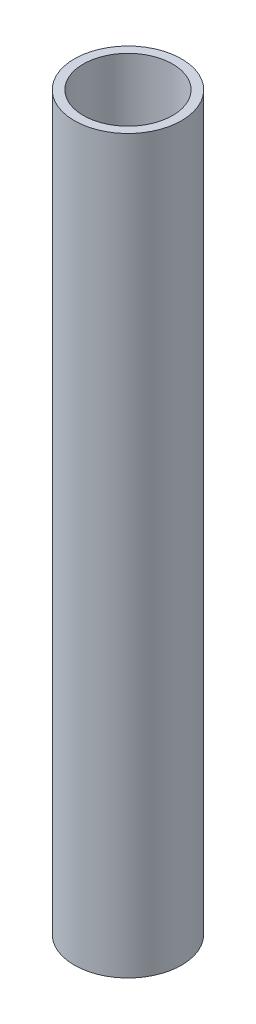
ISO-10303-21;
HEADER;
FILE_DESCRIPTION(('STEP AP214'),'2;1');
FILE_NAME('part.step','',(''),(''),'','','');
FILE_SCHEMA(('AUTOMOTIVE_DESIGN { 1 0 10303 214 1 1 1 1 }'));
ENDSEC;
DATA;
#1=APPLICATION_CONTEXT('core data for automotive mechanical design processes');
#2=APPLICATION_PROTOCOL_DEFINITION('international standard','automotive_design',2000,#1);
#3=PRODUCT_CONTEXT('',#1,'mechanical');
#4=PRODUCT('Part','Part','',(#3));
#5=PRODUCT_RELATED_PRODUCT_CATEGORY('part','',(#4));
#6=PRODUCT_DEFINITION_FORMATION('','',#4);
#7=PRODUCT_DEFINITION_CONTEXT('part definition',#1,'design');
#8=PRODUCT_DEFINITION('design','',#6,#7);
#9=PRODUCT_DEFINITION_SHAPE('','',#8);
#10=(LENGTH_UNIT() NAMED_UNIT(*) SI_UNIT(.MILLI.,.METRE.));
#11=(NAMED_UNIT(*) PLANE_ANGLE_UNIT() SI_UNIT($,.RADIAN.));
#12=(NAMED_UNIT(*) SI_UNIT($,.STERADIAN.) SOLID_ANGLE_UNIT());
#13=UNCERTAINTY_MEASURE_WITH_UNIT(LENGTH_MEASURE(1.E-05),#10,'distance_accuracy_value','');
#14=(GEOMETRIC_REPRESENTATION_CONTEXT(3) GLOBAL_UNCERTAINTY_ASSIGNED_CONTEXT((#13)) GLOBAL_UNIT_ASSIGNED_CONTEXT((#10,
#11,#12)) REPRESENTATION_CONTEXT('',''));
#15=CARTESIAN_POINT('',(0.,0.,0.));
#16=DIRECTION('',(0.,0.,1.));
#17=DIRECTION('',(1.,0.,0.));
#18=AXIS2_PLACEMENT_3D('',#15,#16,#17);
#19=CARTESIAN_POINT('',(0.,130.,0.));
#20=DIRECTION('',(0.,1.,0.));
#21=DIRECTION('',(0.,0.,1.));
#22=AXIS2_PLACEMENT_3D('',#19,#20,#21);
#23=PLANE('',#22);
#24=CARTESIAN_POINT('',(0.,130.,0.));
#25=DIRECTION('',(0.,1.,0.));
#26=DIRECTION('',(0.,0.,1.));
#27=AXIS2_PLACEMENT_3D('',#24,#25,#26);
#28=CIRCLE('',#27,9.525);
#29=CARTESIAN_POINT('',(0.,130.,9.525));
#30=VERTEX_POINT('',#29);
#31=EDGE_CURVE('E11',#30,#30,#28,.T.);
#32=ORIENTED_EDGE('',*,*,#31,.T.);
#33=EDGE_LOOP('',(#32));
#34=FACE_BOUND('',#33,.T.);
#35=CARTESIAN_POINT('',(0.,130.,0.));
#36=DIRECTION('',(0.,1.,0.));
#37=DIRECTION('',(1.,0.,0.));
#38=AXIS2_PLACEMENT_3D('',#35,#36,#37);
#39=CIRCLE('',#38,7.9375);
#40=CARTESIAN_POINT('',(7.9375,130.,0.));
#41=VERTEX_POINT('',#40);
#42=EDGE_CURVE('E47',#41,#41,#39,.T.);
#43=ORIENTED_EDGE('',*,*,#42,.F.);
#44=EDGE_LOOP('',(#43));
#45=FACE_BOUND('',#44,.T.);
#46=ADVANCED_FACE('F36',(#34,#45),#23,.T.);
#47=CARTESIAN_POINT('',(0.,0.,0.));
#48=DIRECTION('',(0.,1.,0.));
#49=DIRECTION('',(0.,0.,1.));
#50=AXIS2_PLACEMENT_3D('',#47,#48,#49);
#51=PLANE('',#50);
#52=CARTESIAN_POINT('',(0.,0.,0.));
#53=DIRECTION('',(0.,1.,0.));
#54=DIRECTION('',(0.,0.,1.));
#55=AXIS2_PLACEMENT_3D('',#52,#53,#54);
#56=CIRCLE('',#55,9.525);
#57=CARTESIAN_POINT('',(0.,0.,9.525));
#58=VERTEX_POINT('',#57);
#59=EDGE_CURVE('E40',#58,#58,#56,.T.);
#60=ORIENTED_EDGE('',*,*,#59,.F.);
#61=EDGE_LOOP('',(#60));
#62=FACE_BOUND('',#61,.T.);
#63=CARTESIAN_POINT('',(0.,0.,0.));
#64=DIRECTION('',(0.,1.,0.));
#65=DIRECTION('',(1.,0.,0.));
#66=AXIS2_PLACEMENT_3D('',#63,#64,#65);
#67=CIRCLE('',#66,7.9375);
#68=CARTESIAN_POINT('',(7.9375,0.,0.));
#69=VERTEX_POINT('',#68);
#70=EDGE_CURVE('E49',#69,#69,#67,.T.);
#71=ORIENTED_EDGE('',*,*,#70,.T.);
#72=EDGE_LOOP('',(#71));
#73=FACE_BOUND('',#72,.T.);
#74=ADVANCED_FACE('F59',(#62,#73),#51,.F.);
#75=CARTESIAN_POINT('',(0.,130.,0.));
#76=DIRECTION('',(0.,-1.,0.));
#77=DIRECTION('',(0.,0.,-1.));
#78=AXIS2_PLACEMENT_3D('',#75,#76,#77);
#79=CYLINDRICAL_SURFACE('',#78,9.525);
#80=ORIENTED_EDGE('',*,*,#31,.F.);
#81=EDGE_LOOP('',(#80));
#82=FACE_BOUND('',#81,.T.);
#83=ORIENTED_EDGE('',*,*,#59,.T.);
#84=EDGE_LOOP('',(#83));
#85=FACE_BOUND('',#84,.T.);
#86=ADVANCED_FACE('F38',(#82,#85),#79,.T.);
#87=CARTESIAN_POINT('',(0.,130.,0.));
#88=DIRECTION('',(0.,-1.,0.));
#89=DIRECTION('',(0.,0.,-1.));
#90=AXIS2_PLACEMENT_3D('',#87,#88,#89);
#91=CYLINDRICAL_SURFACE('',#90,7.9375);
#92=ORIENTED_EDGE('',*,*,#42,.T.);
#93=EDGE_LOOP('',(#92));
#94=FACE_BOUND('',#93,.T.);
#95=ORIENTED_EDGE('',*,*,#70,.F.);
#96=EDGE_LOOP('',(#95));
#97=FACE_BOUND('',#96,.T.);
#98=ADVANCED_FACE('F55',(#94,#97),#91,.F.);
#99=CLOSED_SHELL('',(#46,#74,#86,#98));
#100=MANIFOLD_SOLID_BREP('B2',#99);
#101=ADVANCED_BREP_SHAPE_REPRESENTATION('',(#18,#100),#14);
#102=SHAPE_DEFINITION_REPRESENTATION(#9,#101);
ENDSEC;
END-ISO-10303-21;
